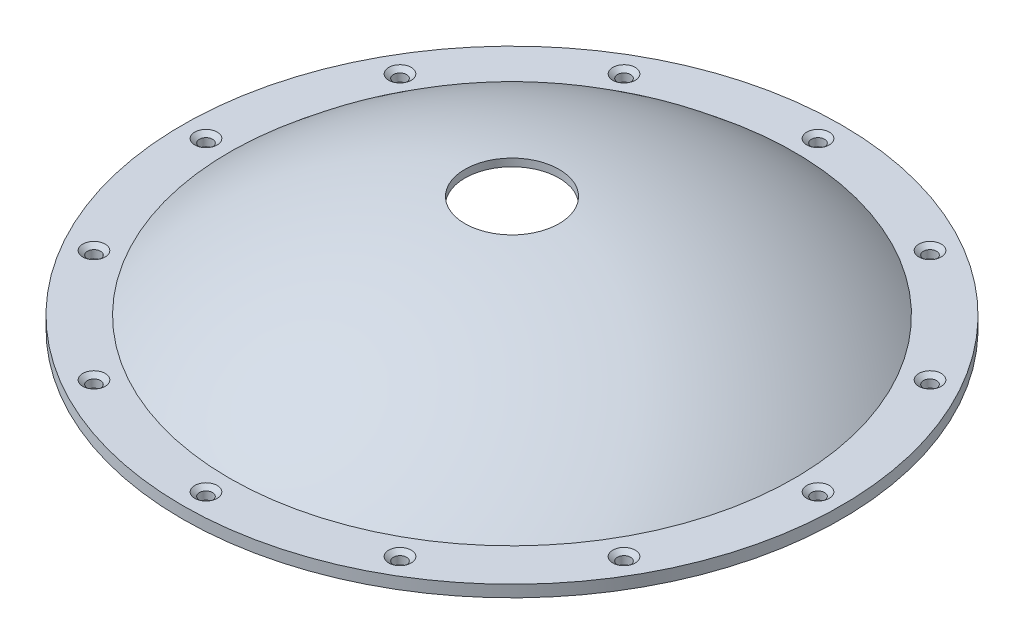
ISO-10303-21;
HEADER;
FILE_DESCRIPTION(('STEP AP214'),'2;1');
FILE_NAME('part.step','',(''),(''),'','','');
FILE_SCHEMA(('AUTOMOTIVE_DESIGN { 1 0 10303 214 1 1 1 1 }'));
ENDSEC;
DATA;
#1=APPLICATION_CONTEXT('core data for automotive mechanical design processes');
#2=APPLICATION_PROTOCOL_DEFINITION('international standard','automotive_design',2000,#1);
#3=PRODUCT_CONTEXT('',#1,'mechanical');
#4=PRODUCT('Part','Part','',(#3));
#5=PRODUCT_RELATED_PRODUCT_CATEGORY('part','',(#4));
#6=PRODUCT_DEFINITION_FORMATION('','',#4);
#7=PRODUCT_DEFINITION_CONTEXT('part definition',#1,'design');
#8=PRODUCT_DEFINITION('design','',#6,#7);
#9=PRODUCT_DEFINITION_SHAPE('','',#8);
#10=(LENGTH_UNIT() NAMED_UNIT(*) SI_UNIT(.MILLI.,.METRE.));
#11=(NAMED_UNIT(*) PLANE_ANGLE_UNIT() SI_UNIT($,.RADIAN.));
#12=(NAMED_UNIT(*) SI_UNIT($,.STERADIAN.) SOLID_ANGLE_UNIT());
#13=UNCERTAINTY_MEASURE_WITH_UNIT(LENGTH_MEASURE(1.E-05),#10,'distance_accuracy_value','');
#14=(GEOMETRIC_REPRESENTATION_CONTEXT(3) GLOBAL_UNCERTAINTY_ASSIGNED_CONTEXT((#13)) GLOBAL_UNIT_ASSIGNED_CONTEXT((#10,
#11,#12)) REPRESENTATION_CONTEXT('',''));
#15=CARTESIAN_POINT('',(0.,0.,0.));
#16=DIRECTION('',(0.,0.,1.));
#17=DIRECTION('',(1.,0.,0.));
#18=AXIS2_PLACEMENT_3D('',#15,#16,#17);
#19=CARTESIAN_POINT('',(-44.45,0.,0.));
#20=DIRECTION('',(0.,-1.,0.));
#21=DIRECTION('',(0.,0.,-1.));
#22=AXIS2_PLACEMENT_3D('',#19,#20,#21);
#23=PLANE('',#22);
#24=CARTESIAN_POINT('',(0.,0.,0.));
#25=DIRECTION('',(0.,1.,0.));
#26=DIRECTION('',(0.,0.,1.));
#27=AXIS2_PLACEMENT_3D('',#24,#25,#26);
#28=CIRCLE('',#27,44.45);
#29=CARTESIAN_POINT('',(0.,0.,44.45));
#30=VERTEX_POINT('',#29);
#31=EDGE_CURVE('E57',#30,#30,#28,.T.);
#32=ORIENTED_EDGE('',*,*,#31,.F.);
#33=EDGE_LOOP('',(#32));
#34=FACE_BOUND('',#33,.T.);
#35=CARTESIAN_POINT('',(0.,0.,0.));
#36=DIRECTION('',(0.,1.,0.));
#37=DIRECTION('',(0.,0.,1.));
#38=AXIS2_PLACEMENT_3D('',#35,#36,#37);
#39=CIRCLE('',#38,38.1);
#40=CARTESIAN_POINT('',(0.,0.,38.1));
#41=VERTEX_POINT('',#40);
#42=EDGE_CURVE('E54',#41,#41,#39,.T.);
#43=ORIENTED_EDGE('',*,*,#42,.T.);
#44=EDGE_LOOP('',(#43));
#45=FACE_BOUND('',#44,.T.);
#46=CARTESIAN_POINT('',(-41.275,0.,0.));
#47=DIRECTION('',(0.,1.,0.));
#48=DIRECTION('',(0.,0.,1.));
#49=AXIS2_PLACEMENT_3D('',#46,#47,#48);
#50=CIRCLE('',#49,0.889000000000001);
#51=CARTESIAN_POINT('',(-41.275,0.,0.889000000000006));
#52=VERTEX_POINT('',#51);
#53=EDGE_CURVE('E60',#52,#52,#50,.T.);
#54=ORIENTED_EDGE('',*,*,#53,.T.);
#55=EDGE_LOOP('',(#54));
#56=FACE_BOUND('',#55,.T.);
#57=CARTESIAN_POINT('',(-35.7451985412027,0.,-20.6375));
#58=DIRECTION('',(0.,1.,0.));
#59=DIRECTION('',(0.,0.,1.));
#60=AXIS2_PLACEMENT_3D('',#57,#58,#59);
#61=CIRCLE('',#60,0.889000000000001);
#62=CARTESIAN_POINT('',(-35.7451985412027,0.,-19.7485));
#63=VERTEX_POINT('',#62);
#64=EDGE_CURVE('E69',#63,#63,#61,.T.);
#65=ORIENTED_EDGE('',*,*,#64,.T.);
#66=EDGE_LOOP('',(#65));
#67=FACE_BOUND('',#66,.T.);
#68=CARTESIAN_POINT('',(-20.6374999999999,0.,-35.7451985412027));
#69=DIRECTION('',(0.,1.,0.));
#70=DIRECTION('',(0.,0.,1.));
#71=AXIS2_PLACEMENT_3D('',#68,#69,#70);
#72=CIRCLE('',#71,0.889000000000001);
#73=CARTESIAN_POINT('',(-20.6374999999999,0.,-34.8561985412027));
#74=VERTEX_POINT('',#73);
#75=EDGE_CURVE('E78',#74,#74,#72,.T.);
#76=ORIENTED_EDGE('',*,*,#75,.T.);
#77=EDGE_LOOP('',(#76));
#78=FACE_BOUND('',#77,.T.);
#79=CARTESIAN_POINT('',(1.11561489392428E-13,0.,-41.275));
#80=DIRECTION('',(0.,1.,0.));
#81=DIRECTION('',(0.,0.,1.));
#82=AXIS2_PLACEMENT_3D('',#79,#80,#81);
#83=CIRCLE('',#82,0.888999999999999);
#84=CARTESIAN_POINT('',(1.11561489392428E-13,0.,-40.386));
#85=VERTEX_POINT('',#84);
#86=EDGE_CURVE('E87',#85,#85,#83,.T.);
#87=ORIENTED_EDGE('',*,*,#86,.T.);
#88=EDGE_LOOP('',(#87));
#89=FACE_BOUND('',#88,.T.);
#90=CARTESIAN_POINT('',(20.6375000000001,0.,-35.7451985412026));
#91=DIRECTION('',(0.,1.,0.));
#92=DIRECTION('',(0.,0.,1.));
#93=AXIS2_PLACEMENT_3D('',#90,#91,#92);
#94=CIRCLE('',#93,0.889000000000001);
#95=CARTESIAN_POINT('',(20.6375000000001,0.,-34.8561985412026));
#96=VERTEX_POINT('',#95);
#97=EDGE_CURVE('E96',#96,#96,#94,.T.);
#98=ORIENTED_EDGE('',*,*,#97,.T.);
#99=EDGE_LOOP('',(#98));
#100=FACE_BOUND('',#99,.T.);
#101=CARTESIAN_POINT('',(35.7451985412028,0.,-20.6374999999998));
#102=DIRECTION('',(0.,1.,0.));
#103=DIRECTION('',(0.,0.,1.));
#104=AXIS2_PLACEMENT_3D('',#101,#102,#103);
#105=CIRCLE('',#104,0.889000000000001);
#106=CARTESIAN_POINT('',(35.7451985412028,0.,-19.7484999999998));
#107=VERTEX_POINT('',#106);
#108=EDGE_CURVE('E105',#107,#107,#105,.T.);
#109=ORIENTED_EDGE('',*,*,#108,.T.);
#110=EDGE_LOOP('',(#109));
#111=FACE_BOUND('',#110,.T.);
#112=CARTESIAN_POINT('',(41.275,0.,2.28177708448336E-13));
#113=DIRECTION('',(0.,1.,0.));
#114=DIRECTION('',(0.,0.,1.));
#115=AXIS2_PLACEMENT_3D('',#112,#113,#114);
#116=CIRCLE('',#115,0.889000000000001);
#117=CARTESIAN_POINT('',(41.275,0.,0.889000000000229));
#118=VERTEX_POINT('',#117);
#119=EDGE_CURVE('E114',#118,#118,#116,.T.);
#120=ORIENTED_EDGE('',*,*,#119,.T.);
#121=EDGE_LOOP('',(#120));
#122=FACE_BOUND('',#121,.T.);
#123=CARTESIAN_POINT('',(35.7451985412026,0.,20.6375000000002));
#124=DIRECTION('',(0.,1.,0.));
#125=DIRECTION('',(0.,0.,1.));
#126=AXIS2_PLACEMENT_3D('',#123,#124,#125);
#127=CIRCLE('',#126,0.889000000000001);
#128=CARTESIAN_POINT('',(35.7451985412026,0.,21.5265000000002));
#129=VERTEX_POINT('',#128);
#130=EDGE_CURVE('E123',#129,#129,#127,.T.);
#131=ORIENTED_EDGE('',*,*,#130,.T.);
#132=EDGE_LOOP('',(#131));
#133=FACE_BOUND('',#132,.T.);
#134=CARTESIAN_POINT('',(20.6374999999997,0.,35.7451985412029));
#135=DIRECTION('',(0.,1.,0.));
#136=DIRECTION('',(0.,0.,1.));
#137=AXIS2_PLACEMENT_3D('',#134,#135,#136);
#138=CIRCLE('',#137,0.889000000000001);
#139=CARTESIAN_POINT('',(20.6374999999997,0.,36.6341985412029));
#140=VERTEX_POINT('',#139);
#141=EDGE_CURVE('E132',#140,#140,#138,.T.);
#142=ORIENTED_EDGE('',*,*,#141,.T.);
#143=EDGE_LOOP('',(#142));
#144=FACE_BOUND('',#143,.T.);
#145=CARTESIAN_POINT('',(-3.53958818572525E-13,0.,41.275));
#146=DIRECTION('',(0.,1.,0.));
#147=DIRECTION('',(0.,0.,1.));
#148=AXIS2_PLACEMENT_3D('',#145,#146,#147);
#149=CIRCLE('',#148,0.888999999999999);
#150=CARTESIAN_POINT('',(-3.53958818572525E-13,0.,42.164));
#151=VERTEX_POINT('',#150);
#152=EDGE_CURVE('E141',#151,#151,#149,.T.);
#153=ORIENTED_EDGE('',*,*,#152,.T.);
#154=EDGE_LOOP('',(#153));
#155=FACE_BOUND('',#154,.T.);
#156=CARTESIAN_POINT('',(-20.6375000000004,0.,35.7451985412025));
#157=DIRECTION('',(0.,1.,0.));
#158=DIRECTION('',(0.,0.,1.));
#159=AXIS2_PLACEMENT_3D('',#156,#157,#158);
#160=CIRCLE('',#159,0.889000000000001);
#161=CARTESIAN_POINT('',(-20.6375000000004,0.,36.6341985412025));
#162=VERTEX_POINT('',#161);
#163=EDGE_CURVE('E150',#162,#162,#160,.T.);
#164=ORIENTED_EDGE('',*,*,#163,.T.);
#165=EDGE_LOOP('',(#164));
#166=FACE_BOUND('',#165,.T.);
#167=CARTESIAN_POINT('',(-35.7451985412029,0.,20.6374999999996));
#168=DIRECTION('',(0.,1.,0.));
#169=DIRECTION('',(0.,0.,1.));
#170=AXIS2_PLACEMENT_3D('',#167,#168,#169);
#171=CIRCLE('',#170,0.889000000000001);
#172=CARTESIAN_POINT('',(-35.7451985412029,0.,21.5264999999996));
#173=VERTEX_POINT('',#172);
#174=EDGE_CURVE('E159',#173,#173,#171,.T.);
#175=ORIENTED_EDGE('',*,*,#174,.T.);
#176=EDGE_LOOP('',(#175));
#177=FACE_BOUND('',#176,.T.);
#178=ADVANCED_FACE('F31',(#34,#45,#56,#67,#78,#89,#100,#111,#122,#133,#144,#155,#166,#177),#23,.T.);
#179=CARTESIAN_POINT('',(0.,55.,0.));
#180=DIRECTION('',(0.,1.,0.));
#181=DIRECTION('',(0.,0.,1.));
#182=AXIS2_PLACEMENT_3D('',#179,#180,#181);
#183=CYLINDRICAL_SURFACE('',#182,44.45);
#184=ORIENTED_EDGE('',*,*,#31,.T.);
#185=EDGE_LOOP('',(#184));
#186=FACE_BOUND('',#185,.T.);
#187=CARTESIAN_POINT('',(0.,1.5875,0.));
#188=DIRECTION('',(0.,1.,0.));
#189=DIRECTION('',(0.,0.,1.));
#190=AXIS2_PLACEMENT_3D('',#187,#188,#189);
#191=CIRCLE('',#190,44.45);
#192=CARTESIAN_POINT('',(0.,1.5875,44.45));
#193=VERTEX_POINT('',#192);
#194=EDGE_CURVE('E10',#193,#193,#191,.T.);
#195=ORIENTED_EDGE('',*,*,#194,.F.);
#196=EDGE_LOOP('',(#195));
#197=FACE_BOUND('',#196,.T.);
#198=ADVANCED_FACE('F33',(#186,#197),#183,.T.);
#199=CARTESIAN_POINT('',(-44.45,1.5875,0.));
#200=DIRECTION('',(0.,1.,0.));
#201=DIRECTION('',(0.,0.,1.));
#202=AXIS2_PLACEMENT_3D('',#199,#200,#201);
#203=PLANE('',#202);
#204=CARTESIAN_POINT('',(-35.7451985412029,1.5875,20.6374999999996));
#205=DIRECTION('',(0.,1.,0.));
#206=DIRECTION('',(0.,0.,1.));
#207=AXIS2_PLACEMENT_3D('',#204,#205,#206);
#208=CIRCLE('',#207,1.5113);
#209=CARTESIAN_POINT('',(-35.7451985412029,1.5875,22.1487999999996));
#210=VERTEX_POINT('',#209);
#211=EDGE_CURVE('E165',#210,#210,#208,.T.);
#212=ORIENTED_EDGE('',*,*,#211,.F.);
#213=EDGE_LOOP('',(#212));
#214=FACE_BOUND('',#213,.T.);
#215=CARTESIAN_POINT('',(-20.6375000000004,1.5875,35.7451985412025));
#216=DIRECTION('',(0.,1.,0.));
#217=DIRECTION('',(0.,0.,1.));
#218=AXIS2_PLACEMENT_3D('',#215,#216,#217);
#219=CIRCLE('',#218,1.5113);
#220=CARTESIAN_POINT('',(-20.6375000000004,1.5875,37.2564985412025));
#221=VERTEX_POINT('',#220);
#222=EDGE_CURVE('E156',#221,#221,#219,.T.);
#223=ORIENTED_EDGE('',*,*,#222,.F.);
#224=EDGE_LOOP('',(#223));
#225=FACE_BOUND('',#224,.T.);
#226=CARTESIAN_POINT('',(-3.53958818572525E-13,1.5875,41.275));
#227=DIRECTION('',(0.,1.,0.));
#228=DIRECTION('',(0.,0.,1.));
#229=AXIS2_PLACEMENT_3D('',#226,#227,#228);
#230=CIRCLE('',#229,1.5113);
#231=CARTESIAN_POINT('',(-3.53958818572525E-13,1.5875,42.7863));
#232=VERTEX_POINT('',#231);
#233=EDGE_CURVE('E147',#232,#232,#230,.T.);
#234=ORIENTED_EDGE('',*,*,#233,.F.);
#235=EDGE_LOOP('',(#234));
#236=FACE_BOUND('',#235,.T.);
#237=CARTESIAN_POINT('',(20.6374999999997,1.5875,35.7451985412029));
#238=DIRECTION('',(0.,1.,0.));
#239=DIRECTION('',(0.,0.,1.));
#240=AXIS2_PLACEMENT_3D('',#237,#238,#239);
#241=CIRCLE('',#240,1.5113);
#242=CARTESIAN_POINT('',(20.6374999999997,1.5875,37.2564985412029));
#243=VERTEX_POINT('',#242);
#244=EDGE_CURVE('E138',#243,#243,#241,.T.);
#245=ORIENTED_EDGE('',*,*,#244,.F.);
#246=EDGE_LOOP('',(#245));
#247=FACE_BOUND('',#246,.T.);
#248=CARTESIAN_POINT('',(35.7451985412026,1.5875,20.6375000000002));
#249=DIRECTION('',(0.,1.,0.));
#250=DIRECTION('',(0.,0.,1.));
#251=AXIS2_PLACEMENT_3D('',#248,#249,#250);
#252=CIRCLE('',#251,1.5113);
#253=CARTESIAN_POINT('',(35.7451985412026,1.5875,22.1488000000002));
#254=VERTEX_POINT('',#253);
#255=EDGE_CURVE('E129',#254,#254,#252,.T.);
#256=ORIENTED_EDGE('',*,*,#255,.F.);
#257=EDGE_LOOP('',(#256));
#258=FACE_BOUND('',#257,.T.);
#259=CARTESIAN_POINT('',(41.275,1.5875,2.28177708448336E-13));
#260=DIRECTION('',(0.,1.,0.));
#261=DIRECTION('',(0.,0.,1.));
#262=AXIS2_PLACEMENT_3D('',#259,#260,#261);
#263=CIRCLE('',#262,1.5113);
#264=CARTESIAN_POINT('',(41.275,1.5875,1.51130000000023));
#265=VERTEX_POINT('',#264);
#266=EDGE_CURVE('E120',#265,#265,#263,.T.);
#267=ORIENTED_EDGE('',*,*,#266,.F.);
#268=EDGE_LOOP('',(#267));
#269=FACE_BOUND('',#268,.T.);
#270=CARTESIAN_POINT('',(35.7451985412028,1.5875,-20.6374999999998));
#271=DIRECTION('',(0.,1.,0.));
#272=DIRECTION('',(0.,0.,1.));
#273=AXIS2_PLACEMENT_3D('',#270,#271,#272);
#274=CIRCLE('',#273,1.5113);
#275=CARTESIAN_POINT('',(35.7451985412028,1.5875,-19.1261999999998));
#276=VERTEX_POINT('',#275);
#277=EDGE_CURVE('E111',#276,#276,#274,.T.);
#278=ORIENTED_EDGE('',*,*,#277,.F.);
#279=EDGE_LOOP('',(#278));
#280=FACE_BOUND('',#279,.T.);
#281=CARTESIAN_POINT('',(20.6375000000001,1.5875,-35.7451985412026));
#282=DIRECTION('',(0.,1.,0.));
#283=DIRECTION('',(0.,0.,1.));
#284=AXIS2_PLACEMENT_3D('',#281,#282,#283);
#285=CIRCLE('',#284,1.5113);
#286=CARTESIAN_POINT('',(20.6375000000001,1.5875,-34.2338985412026));
#287=VERTEX_POINT('',#286);
#288=EDGE_CURVE('E102',#287,#287,#285,.T.);
#289=ORIENTED_EDGE('',*,*,#288,.F.);
#290=EDGE_LOOP('',(#289));
#291=FACE_BOUND('',#290,.T.);
#292=CARTESIAN_POINT('',(1.11561489392428E-13,1.5875,-41.275));
#293=DIRECTION('',(0.,1.,0.));
#294=DIRECTION('',(0.,0.,1.));
#295=AXIS2_PLACEMENT_3D('',#292,#293,#294);
#296=CIRCLE('',#295,1.5113);
#297=CARTESIAN_POINT('',(1.11561489392428E-13,1.5875,-39.7637));
#298=VERTEX_POINT('',#297);
#299=EDGE_CURVE('E93',#298,#298,#296,.T.);
#300=ORIENTED_EDGE('',*,*,#299,.F.);
#301=EDGE_LOOP('',(#300));
#302=FACE_BOUND('',#301,.T.);
#303=CARTESIAN_POINT('',(-20.6374999999999,1.5875,-35.7451985412027));
#304=DIRECTION('',(0.,1.,0.));
#305=DIRECTION('',(0.,0.,1.));
#306=AXIS2_PLACEMENT_3D('',#303,#304,#305);
#307=CIRCLE('',#306,1.5113);
#308=CARTESIAN_POINT('',(-20.6374999999999,1.5875,-34.2338985412027));
#309=VERTEX_POINT('',#308);
#310=EDGE_CURVE('E84',#309,#309,#307,.T.);
#311=ORIENTED_EDGE('',*,*,#310,.F.);
#312=EDGE_LOOP('',(#311));
#313=FACE_BOUND('',#312,.T.);
#314=CARTESIAN_POINT('',(-35.7451985412027,1.5875,-20.6375));
#315=DIRECTION('',(0.,1.,0.));
#316=DIRECTION('',(0.,0.,1.));
#317=AXIS2_PLACEMENT_3D('',#314,#315,#316);
#318=CIRCLE('',#317,1.5113);
#319=CARTESIAN_POINT('',(-35.7451985412027,1.5875,-19.1262));
#320=VERTEX_POINT('',#319);
#321=EDGE_CURVE('E75',#320,#320,#318,.T.);
#322=ORIENTED_EDGE('',*,*,#321,.F.);
#323=EDGE_LOOP('',(#322));
#324=FACE_BOUND('',#323,.T.);
#325=CARTESIAN_POINT('',(-41.275,1.5875,0.));
#326=DIRECTION('',(0.,1.,0.));
#327=DIRECTION('',(0.,0.,1.));
#328=AXIS2_PLACEMENT_3D('',#325,#326,#327);
#329=CIRCLE('',#328,1.5113);
#330=CARTESIAN_POINT('',(-41.275,1.5875,1.51130000000001));
#331=VERTEX_POINT('',#330);
#332=EDGE_CURVE('E66',#331,#331,#329,.T.);
#333=ORIENTED_EDGE('',*,*,#332,.F.);
#334=EDGE_LOOP('',(#333));
#335=FACE_BOUND('',#334,.T.);
#336=ORIENTED_EDGE('',*,*,#194,.T.);
#337=EDGE_LOOP('',(#336));
#338=FACE_BOUND('',#337,.T.);
#339=CARTESIAN_POINT('',(0.,1.5875,0.));
#340=DIRECTION('',(0.,1.,0.));
#341=DIRECTION('',(0.,0.,1.));
#342=AXIS2_PLACEMENT_3D('',#339,#340,#341);
#343=CIRCLE('',#342,38.1);
#344=CARTESIAN_POINT('',(0.,1.5875,38.1));
#345=VERTEX_POINT('',#344);
#346=EDGE_CURVE('E38',#345,#345,#343,.T.);
#347=ORIENTED_EDGE('',*,*,#346,.F.);
#348=EDGE_LOOP('',(#347));
#349=FACE_BOUND('',#348,.T.);
#350=ADVANCED_FACE('F171',(#214,#225,#236,#247,#258,#269,#280,#291,#302,#313,#324,#335,#338,
#349),#203,.T.);
#351=CARTESIAN_POINT('',(0.,-42.3633083657172,0.));
#352=DIRECTION('',(0.,1.,0.));
#353=DIRECTION('',(-1.,0.,0.));
#354=AXIS2_PLACEMENT_3D('',#351,#352,#353);
#355=SPHERICAL_SURFACE('',#354,58.166);
#356=ORIENTED_EDGE('',*,*,#346,.T.);
#357=EDGE_LOOP('',(#356));
#358=FACE_BOUND('',#357,.T.);
#359=CARTESIAN_POINT('',(0.,15.4550369582368,0.));
#360=DIRECTION('',(0.,1.,0.));
#361=DIRECTION('',(0.,0.,1.));
#362=AXIS2_PLACEMENT_3D('',#359,#360,#361);
#363=CIRCLE('',#362,6.35000000000001);
#364=CARTESIAN_POINT('',(0.,15.4550369582368,6.35000000000001));
#365=VERTEX_POINT('',#364);
#366=EDGE_CURVE('E42',#365,#365,#363,.T.);
#367=ORIENTED_EDGE('',*,*,#366,.F.);
#368=EDGE_LOOP('',(#367));
#369=FACE_BOUND('',#368,.T.);
#370=ADVANCED_FACE('F174',(#358,#369),#355,.T.);
#371=CARTESIAN_POINT('',(0.,55.,0.));
#372=DIRECTION('',(0.,1.,0.));
#373=DIRECTION('',(0.,0.,1.));
#374=AXIS2_PLACEMENT_3D('',#371,#372,#373);
#375=CYLINDRICAL_SURFACE('',#374,6.35000000000001);
#376=ORIENTED_EDGE('',*,*,#366,.T.);
#377=EDGE_LOOP('',(#376));
#378=FACE_BOUND('',#377,.T.);
#379=CARTESIAN_POINT('',(0.,14.4328182627774,0.));
#380=DIRECTION('',(0.,1.,0.));
#381=DIRECTION('',(0.,0.,1.));
#382=AXIS2_PLACEMENT_3D('',#379,#380,#381);
#383=CIRCLE('',#382,6.35000000000001);
#384=CARTESIAN_POINT('',(0.,14.4328182627774,6.35000000000001));
#385=VERTEX_POINT('',#384);
#386=EDGE_CURVE('E46',#385,#385,#383,.T.);
#387=ORIENTED_EDGE('',*,*,#386,.F.);
#388=EDGE_LOOP('',(#387));
#389=FACE_BOUND('',#388,.T.);
#390=ADVANCED_FACE('F231',(#378,#389),#375,.F.);
#391=CARTESIAN_POINT('',(0.,-42.3633083657172,0.));
#392=DIRECTION('',(0.,1.,0.));
#393=DIRECTION('',(-1.,0.,0.));
#394=AXIS2_PLACEMENT_3D('',#391,#392,#393);
#395=SPHERICAL_SURFACE('',#394,57.15);
#396=ORIENTED_EDGE('',*,*,#386,.T.);
#397=EDGE_LOOP('',(#396));
#398=FACE_BOUND('',#397,.T.);
#399=CARTESIAN_POINT('',(0.,0.390000091335399,0.));
#400=DIRECTION('',(0.,1.,0.));
#401=DIRECTION('',(0.,0.,1.));
#402=AXIS2_PLACEMENT_3D('',#399,#400,#401);
#403=CIRCLE('',#402,37.924624137572);
#404=CARTESIAN_POINT('',(0.,0.390000091335399,37.924624137572));
#405=VERTEX_POINT('',#404);
#406=EDGE_CURVE('E51',#405,#405,#403,.T.);
#407=ORIENTED_EDGE('',*,*,#406,.F.);
#408=EDGE_LOOP('',(#407));
#409=FACE_BOUND('',#408,.T.);
#410=ADVANCED_FACE('F227',(#398,#409),#395,.F.);
#411=CARTESIAN_POINT('',(0.,0.,0.));
#412=DIRECTION('',(0.,1.,0.));
#413=DIRECTION('',(0.,0.,1.));
#414=AXIS2_PLACEMENT_3D('',#411,#412,#413);
#415=TOROIDAL_SURFACE('',#414,37.5786718028569,0.521328197143094);
#416=ORIENTED_EDGE('',*,*,#406,.T.);
#417=EDGE_LOOP('',(#416));
#418=FACE_BOUND('',#417,.T.);
#419=ORIENTED_EDGE('',*,*,#42,.F.);
#420=EDGE_LOOP('',(#419));
#421=FACE_BOUND('',#420,.T.);
#422=ADVANCED_FACE('F211',(#418,#421),#415,.F.);
#423=CARTESIAN_POINT('',(-41.275,1.5875,0.));
#424=DIRECTION('',(0.,1.,0.));
#425=DIRECTION('',(0.,0.,1.));
#426=AXIS2_PLACEMENT_3D('',#423,#424,#425);
#427=CYLINDRICAL_SURFACE('',#426,0.889000000000001);
#428=ORIENTED_EDGE('',*,*,#53,.F.);
#429=EDGE_LOOP('',(#428));
#430=FACE_BOUND('',#429,.T.);
#431=CARTESIAN_POINT('',(-41.275,1.06532829951838,0.));
#432=DIRECTION('',(0.,1.,0.));
#433=DIRECTION('',(0.,0.,1.));
#434=AXIS2_PLACEMENT_3D('',#431,#432,#433);
#435=CIRCLE('',#434,0.889000000000001);
#436=CARTESIAN_POINT('',(-41.275,1.06532829951838,0.889000000000006));
#437=VERTEX_POINT('',#436);
#438=EDGE_CURVE('E63',#437,#437,#435,.T.);
#439=ORIENTED_EDGE('',*,*,#438,.T.);
#440=EDGE_LOOP('',(#439));
#441=FACE_BOUND('',#440,.T.);
#442=ADVANCED_FACE('F201',(#430,#441),#427,.F.);
#443=CARTESIAN_POINT('',(-41.275,1.5875,0.));
#444=DIRECTION('',(0.,1.,0.));
#445=DIRECTION('',(0.,0.,1.));
#446=AXIS2_PLACEMENT_3D('',#443,#444,#445);
#447=CONICAL_SURFACE('',#446,1.5113,0.872664625997162);
#448=ORIENTED_EDGE('',*,*,#438,.F.);
#449=EDGE_LOOP('',(#448));
#450=FACE_BOUND('',#449,.T.);
#451=ORIENTED_EDGE('',*,*,#332,.T.);
#452=EDGE_LOOP('',(#451));
#453=FACE_BOUND('',#452,.T.);
#454=ADVANCED_FACE('F198',(#450,#453),#447,.F.);
#455=CARTESIAN_POINT('',(-35.7451985412027,1.5875,-20.6375));
#456=DIRECTION('',(0.,1.,0.));
#457=DIRECTION('',(0.,0.,1.));
#458=AXIS2_PLACEMENT_3D('',#455,#456,#457);
#459=CYLINDRICAL_SURFACE('',#458,0.889000000000001);
#460=ORIENTED_EDGE('',*,*,#64,.F.);
#461=EDGE_LOOP('',(#460));
#462=FACE_BOUND('',#461,.T.);
#463=CARTESIAN_POINT('',(-35.7451985412027,1.06532829951838,-20.6375));
#464=DIRECTION('',(0.,1.,0.));
#465=DIRECTION('',(0.,0.,1.));
#466=AXIS2_PLACEMENT_3D('',#463,#464,#465);
#467=CIRCLE('',#466,0.889000000000001);
#468=CARTESIAN_POINT('',(-35.7451985412027,1.06532829951838,-19.7485));
#469=VERTEX_POINT('',#468);
#470=EDGE_CURVE('E72',#469,#469,#467,.T.);
#471=ORIENTED_EDGE('',*,*,#470,.T.);
#472=EDGE_LOOP('',(#471));
#473=FACE_BOUND('',#472,.T.);
#474=ADVANCED_FACE('F200',(#462,#473),#459,.F.);
#475=CARTESIAN_POINT('',(-35.7451985412027,1.5875,-20.6375));
#476=DIRECTION('',(0.,1.,0.));
#477=DIRECTION('',(0.,0.,1.));
#478=AXIS2_PLACEMENT_3D('',#475,#476,#477);
#479=CONICAL_SURFACE('',#478,1.5113,0.872664625997162);
#480=ORIENTED_EDGE('',*,*,#470,.F.);
#481=EDGE_LOOP('',(#480));
#482=FACE_BOUND('',#481,.T.);
#483=ORIENTED_EDGE('',*,*,#321,.T.);
#484=EDGE_LOOP('',(#483));
#485=FACE_BOUND('',#484,.T.);
#486=ADVANCED_FACE('F208',(#482,#485),#479,.F.);
#487=CARTESIAN_POINT('',(-20.6374999999999,1.5875,-35.7451985412027));
#488=DIRECTION('',(0.,1.,0.));
#489=DIRECTION('',(0.,0.,1.));
#490=AXIS2_PLACEMENT_3D('',#487,#488,#489);
#491=CYLINDRICAL_SURFACE('',#490,0.889000000000001);
#492=ORIENTED_EDGE('',*,*,#75,.F.);
#493=EDGE_LOOP('',(#492));
#494=FACE_BOUND('',#493,.T.);
#495=CARTESIAN_POINT('',(-20.6374999999999,1.06532829951838,-35.7451985412027));
#496=DIRECTION('',(0.,1.,0.));
#497=DIRECTION('',(0.,0.,1.));
#498=AXIS2_PLACEMENT_3D('',#495,#496,#497);
#499=CIRCLE('',#498,0.889000000000001);
#500=CARTESIAN_POINT('',(-20.6374999999999,1.06532829951838,-34.8561985412027));
#501=VERTEX_POINT('',#500);
#502=EDGE_CURVE('E81',#501,#501,#499,.T.);
#503=ORIENTED_EDGE('',*,*,#502,.T.);
#504=EDGE_LOOP('',(#503));
#505=FACE_BOUND('',#504,.T.);
#506=ADVANCED_FACE('F350',(#494,#505),#491,.F.);
#507=CARTESIAN_POINT('',(-20.6374999999999,1.5875,-35.7451985412027));
#508=DIRECTION('',(0.,1.,0.));
#509=DIRECTION('',(0.,0.,1.));
#510=AXIS2_PLACEMENT_3D('',#507,#508,#509);
#511=CONICAL_SURFACE('',#510,1.5113,0.872664625997162);
#512=ORIENTED_EDGE('',*,*,#502,.F.);
#513=EDGE_LOOP('',(#512));
#514=FACE_BOUND('',#513,.T.);
#515=ORIENTED_EDGE('',*,*,#310,.T.);
#516=EDGE_LOOP('',(#515));
#517=FACE_BOUND('',#516,.T.);
#518=ADVANCED_FACE('F346',(#514,#517),#511,.F.);
#519=CARTESIAN_POINT('',(1.11561489392428E-13,1.5875,-41.275));
#520=DIRECTION('',(0.,1.,0.));
#521=DIRECTION('',(0.,0.,1.));
#522=AXIS2_PLACEMENT_3D('',#519,#520,#521);
#523=CYLINDRICAL_SURFACE('',#522,0.888999999999999);
#524=ORIENTED_EDGE('',*,*,#86,.F.);
#525=EDGE_LOOP('',(#524));
#526=FACE_BOUND('',#525,.T.);
#527=CARTESIAN_POINT('',(1.11561489392428E-13,1.06532829951838,-41.275));
#528=DIRECTION('',(0.,1.,0.));
#529=DIRECTION('',(0.,0.,1.));
#530=AXIS2_PLACEMENT_3D('',#527,#528,#529);
#531=CIRCLE('',#530,0.888999999999999);
#532=CARTESIAN_POINT('',(1.11561489392428E-13,1.06532829951838,-40.386));
#533=VERTEX_POINT('',#532);
#534=EDGE_CURVE('E90',#533,#533,#531,.T.);
#535=ORIENTED_EDGE('',*,*,#534,.T.);
#536=EDGE_LOOP('',(#535));
#537=FACE_BOUND('',#536,.T.);
#538=ADVANCED_FACE('F342',(#526,#537),#523,.F.);
#539=CARTESIAN_POINT('',(1.11561489392428E-13,1.5875,-41.275));
#540=DIRECTION('',(0.,1.,0.));
#541=DIRECTION('',(0.,0.,1.));
#542=AXIS2_PLACEMENT_3D('',#539,#540,#541);
#543=CONICAL_SURFACE('',#542,1.5113,0.872664625997163);
#544=ORIENTED_EDGE('',*,*,#534,.F.);
#545=EDGE_LOOP('',(#544));
#546=FACE_BOUND('',#545,.T.);
#547=ORIENTED_EDGE('',*,*,#299,.T.);
#548=EDGE_LOOP('',(#547));
#549=FACE_BOUND('',#548,.T.);
#550=ADVANCED_FACE('F338',(#546,#549),#543,.F.);
#551=CARTESIAN_POINT('',(20.6375000000001,1.5875,-35.7451985412026));
#552=DIRECTION('',(0.,1.,0.));
#553=DIRECTION('',(0.,0.,1.));
#554=AXIS2_PLACEMENT_3D('',#551,#552,#553);
#555=CYLINDRICAL_SURFACE('',#554,0.889000000000001);
#556=ORIENTED_EDGE('',*,*,#97,.F.);
#557=EDGE_LOOP('',(#556));
#558=FACE_BOUND('',#557,.T.);
#559=CARTESIAN_POINT('',(20.6375000000001,1.06532829951838,-35.7451985412026));
#560=DIRECTION('',(0.,1.,0.));
#561=DIRECTION('',(0.,0.,1.));
#562=AXIS2_PLACEMENT_3D('',#559,#560,#561);
#563=CIRCLE('',#562,0.889000000000001);
#564=CARTESIAN_POINT('',(20.6375000000001,1.06532829951838,-34.8561985412026));
#565=VERTEX_POINT('',#564);
#566=EDGE_CURVE('E99',#565,#565,#563,.T.);
#567=ORIENTED_EDGE('',*,*,#566,.T.);
#568=EDGE_LOOP('',(#567));
#569=FACE_BOUND('',#568,.T.);
#570=ADVANCED_FACE('F334',(#558,#569),#555,.F.);
#571=CARTESIAN_POINT('',(20.6375000000001,1.5875,-35.7451985412026));
#572=DIRECTION('',(0.,1.,0.));
#573=DIRECTION('',(0.,0.,1.));
#574=AXIS2_PLACEMENT_3D('',#571,#572,#573);
#575=CONICAL_SURFACE('',#574,1.5113,0.872664625997162);
#576=ORIENTED_EDGE('',*,*,#566,.F.);
#577=EDGE_LOOP('',(#576));
#578=FACE_BOUND('',#577,.T.);
#579=ORIENTED_EDGE('',*,*,#288,.T.);
#580=EDGE_LOOP('',(#579));
#581=FACE_BOUND('',#580,.T.);
#582=ADVANCED_FACE('F330',(#578,#581),#575,.F.);
#583=CARTESIAN_POINT('',(35.7451985412028,1.5875,-20.6374999999998));
#584=DIRECTION('',(0.,1.,0.));
#585=DIRECTION('',(0.,0.,1.));
#586=AXIS2_PLACEMENT_3D('',#583,#584,#585);
#587=CYLINDRICAL_SURFACE('',#586,0.889000000000001);
#588=ORIENTED_EDGE('',*,*,#108,.F.);
#589=EDGE_LOOP('',(#588));
#590=FACE_BOUND('',#589,.T.);
#591=CARTESIAN_POINT('',(35.7451985412028,1.06532829951838,-20.6374999999998));
#592=DIRECTION('',(0.,1.,0.));
#593=DIRECTION('',(0.,0.,1.));
#594=AXIS2_PLACEMENT_3D('',#591,#592,#593);
#595=CIRCLE('',#594,0.889000000000001);
#596=CARTESIAN_POINT('',(35.7451985412028,1.06532829951838,-19.7484999999998));
#597=VERTEX_POINT('',#596);
#598=EDGE_CURVE('E108',#597,#597,#595,.T.);
#599=ORIENTED_EDGE('',*,*,#598,.T.);
#600=EDGE_LOOP('',(#599));
#601=FACE_BOUND('',#600,.T.);
#602=ADVANCED_FACE('F326',(#590,#601),#587,.F.);
#603=CARTESIAN_POINT('',(35.7451985412028,1.5875,-20.6374999999998));
#604=DIRECTION('',(0.,1.,0.));
#605=DIRECTION('',(0.,0.,1.));
#606=AXIS2_PLACEMENT_3D('',#603,#604,#605);
#607=CONICAL_SURFACE('',#606,1.5113,0.872664625997162);
#608=ORIENTED_EDGE('',*,*,#598,.F.);
#609=EDGE_LOOP('',(#608));
#610=FACE_BOUND('',#609,.T.);
#611=ORIENTED_EDGE('',*,*,#277,.T.);
#612=EDGE_LOOP('',(#611));
#613=FACE_BOUND('',#612,.T.);
#614=ADVANCED_FACE('F322',(#610,#613),#607,.F.);
#615=CARTESIAN_POINT('',(41.275,1.5875,2.28177708448336E-13));
#616=DIRECTION('',(0.,1.,0.));
#617=DIRECTION('',(0.,0.,1.));
#618=AXIS2_PLACEMENT_3D('',#615,#616,#617);
#619=CYLINDRICAL_SURFACE('',#618,0.889000000000001);
#620=ORIENTED_EDGE('',*,*,#119,.F.);
#621=EDGE_LOOP('',(#620));
#622=FACE_BOUND('',#621,.T.);
#623=CARTESIAN_POINT('',(41.275,1.06532829951838,2.28177708448336E-13));
#624=DIRECTION('',(0.,1.,0.));
#625=DIRECTION('',(0.,0.,1.));
#626=AXIS2_PLACEMENT_3D('',#623,#624,#625);
#627=CIRCLE('',#626,0.889000000000001);
#628=CARTESIAN_POINT('',(41.275,1.06532829951838,0.889000000000229));
#629=VERTEX_POINT('',#628);
#630=EDGE_CURVE('E117',#629,#629,#627,.T.);
#631=ORIENTED_EDGE('',*,*,#630,.T.);
#632=EDGE_LOOP('',(#631));
#633=FACE_BOUND('',#632,.T.);
#634=ADVANCED_FACE('F318',(#622,#633),#619,.F.);
#635=CARTESIAN_POINT('',(41.275,1.5875,2.28177708448336E-13));
#636=DIRECTION('',(0.,1.,0.));
#637=DIRECTION('',(0.,0.,1.));
#638=AXIS2_PLACEMENT_3D('',#635,#636,#637);
#639=CONICAL_SURFACE('',#638,1.5113,0.872664625997162);
#640=ORIENTED_EDGE('',*,*,#630,.F.);
#641=EDGE_LOOP('',(#640));
#642=FACE_BOUND('',#641,.T.);
#643=ORIENTED_EDGE('',*,*,#266,.T.);
#644=EDGE_LOOP('',(#643));
#645=FACE_BOUND('',#644,.T.);
#646=ADVANCED_FACE('F314',(#642,#645),#639,.F.);
#647=CARTESIAN_POINT('',(35.7451985412026,1.5875,20.6375000000002));
#648=DIRECTION('',(0.,1.,0.));
#649=DIRECTION('',(0.,0.,1.));
#650=AXIS2_PLACEMENT_3D('',#647,#648,#649);
#651=CYLINDRICAL_SURFACE('',#650,0.889000000000001);
#652=ORIENTED_EDGE('',*,*,#130,.F.);
#653=EDGE_LOOP('',(#652));
#654=FACE_BOUND('',#653,.T.);
#655=CARTESIAN_POINT('',(35.7451985412026,1.06532829951838,20.6375000000002));
#656=DIRECTION('',(0.,1.,0.));
#657=DIRECTION('',(0.,0.,1.));
#658=AXIS2_PLACEMENT_3D('',#655,#656,#657);
#659=CIRCLE('',#658,0.889000000000001);
#660=CARTESIAN_POINT('',(35.7451985412026,1.06532829951838,21.5265000000002));
#661=VERTEX_POINT('',#660);
#662=EDGE_CURVE('E126',#661,#661,#659,.T.);
#663=ORIENTED_EDGE('',*,*,#662,.T.);
#664=EDGE_LOOP('',(#663));
#665=FACE_BOUND('',#664,.T.);
#666=ADVANCED_FACE('F310',(#654,#665),#651,.F.);
#667=CARTESIAN_POINT('',(35.7451985412026,1.5875,20.6375000000002));
#668=DIRECTION('',(0.,1.,0.));
#669=DIRECTION('',(0.,0.,1.));
#670=AXIS2_PLACEMENT_3D('',#667,#668,#669);
#671=CONICAL_SURFACE('',#670,1.5113,0.872664625997162);
#672=ORIENTED_EDGE('',*,*,#662,.F.);
#673=EDGE_LOOP('',(#672));
#674=FACE_BOUND('',#673,.T.);
#675=ORIENTED_EDGE('',*,*,#255,.T.);
#676=EDGE_LOOP('',(#675));
#677=FACE_BOUND('',#676,.T.);
#678=ADVANCED_FACE('F306',(#674,#677),#671,.F.);
#679=CARTESIAN_POINT('',(20.6374999999997,1.5875,35.7451985412029));
#680=DIRECTION('',(0.,1.,0.));
#681=DIRECTION('',(0.,0.,1.));
#682=AXIS2_PLACEMENT_3D('',#679,#680,#681);
#683=CYLINDRICAL_SURFACE('',#682,0.889000000000001);
#684=ORIENTED_EDGE('',*,*,#141,.F.);
#685=EDGE_LOOP('',(#684));
#686=FACE_BOUND('',#685,.T.);
#687=CARTESIAN_POINT('',(20.6374999999997,1.06532829951838,35.7451985412029));
#688=DIRECTION('',(0.,1.,0.));
#689=DIRECTION('',(0.,0.,1.));
#690=AXIS2_PLACEMENT_3D('',#687,#688,#689);
#691=CIRCLE('',#690,0.889000000000001);
#692=CARTESIAN_POINT('',(20.6374999999997,1.06532829951838,36.6341985412029));
#693=VERTEX_POINT('',#692);
#694=EDGE_CURVE('E135',#693,#693,#691,.T.);
#695=ORIENTED_EDGE('',*,*,#694,.T.);
#696=EDGE_LOOP('',(#695));
#697=FACE_BOUND('',#696,.T.);
#698=ADVANCED_FACE('F302',(#686,#697),#683,.F.);
#699=CARTESIAN_POINT('',(20.6374999999997,1.5875,35.7451985412029));
#700=DIRECTION('',(0.,1.,0.));
#701=DIRECTION('',(0.,0.,1.));
#702=AXIS2_PLACEMENT_3D('',#699,#700,#701);
#703=CONICAL_SURFACE('',#702,1.5113,0.872664625997162);
#704=ORIENTED_EDGE('',*,*,#694,.F.);
#705=EDGE_LOOP('',(#704));
#706=FACE_BOUND('',#705,.T.);
#707=ORIENTED_EDGE('',*,*,#244,.T.);
#708=EDGE_LOOP('',(#707));
#709=FACE_BOUND('',#708,.T.);
#710=ADVANCED_FACE('F298',(#706,#709),#703,.F.);
#711=CARTESIAN_POINT('',(-3.53958818572525E-13,1.5875,41.275));
#712=DIRECTION('',(0.,1.,0.));
#713=DIRECTION('',(0.,0.,1.));
#714=AXIS2_PLACEMENT_3D('',#711,#712,#713);
#715=CYLINDRICAL_SURFACE('',#714,0.888999999999999);
#716=ORIENTED_EDGE('',*,*,#152,.F.);
#717=EDGE_LOOP('',(#716));
#718=FACE_BOUND('',#717,.T.);
#719=CARTESIAN_POINT('',(-3.53958818572525E-13,1.06532829951838,41.275));
#720=DIRECTION('',(0.,1.,0.));
#721=DIRECTION('',(0.,0.,1.));
#722=AXIS2_PLACEMENT_3D('',#719,#720,#721);
#723=CIRCLE('',#722,0.888999999999999);
#724=CARTESIAN_POINT('',(-3.53958818572525E-13,1.06532829951838,42.164));
#725=VERTEX_POINT('',#724);
#726=EDGE_CURVE('E144',#725,#725,#723,.T.);
#727=ORIENTED_EDGE('',*,*,#726,.T.);
#728=EDGE_LOOP('',(#727));
#729=FACE_BOUND('',#728,.T.);
#730=ADVANCED_FACE('F294',(#718,#729),#715,.F.);
#731=CARTESIAN_POINT('',(-3.53958818572525E-13,1.5875,41.275));
#732=DIRECTION('',(0.,1.,0.));
#733=DIRECTION('',(0.,0.,1.));
#734=AXIS2_PLACEMENT_3D('',#731,#732,#733);
#735=CONICAL_SURFACE('',#734,1.5113,0.872664625997163);
#736=ORIENTED_EDGE('',*,*,#726,.F.);
#737=EDGE_LOOP('',(#736));
#738=FACE_BOUND('',#737,.T.);
#739=ORIENTED_EDGE('',*,*,#233,.T.);
#740=EDGE_LOOP('',(#739));
#741=FACE_BOUND('',#740,.T.);
#742=ADVANCED_FACE('F290',(#738,#741),#735,.F.);
#743=CARTESIAN_POINT('',(-20.6375000000004,1.5875,35.7451985412025));
#744=DIRECTION('',(0.,1.,0.));
#745=DIRECTION('',(0.,0.,1.));
#746=AXIS2_PLACEMENT_3D('',#743,#744,#745);
#747=CYLINDRICAL_SURFACE('',#746,0.889000000000001);
#748=ORIENTED_EDGE('',*,*,#163,.F.);
#749=EDGE_LOOP('',(#748));
#750=FACE_BOUND('',#749,.T.);
#751=CARTESIAN_POINT('',(-20.6375000000004,1.06532829951838,35.7451985412025));
#752=DIRECTION('',(0.,1.,0.));
#753=DIRECTION('',(0.,0.,1.));
#754=AXIS2_PLACEMENT_3D('',#751,#752,#753);
#755=CIRCLE('',#754,0.889000000000001);
#756=CARTESIAN_POINT('',(-20.6375000000004,1.06532829951838,36.6341985412025));
#757=VERTEX_POINT('',#756);
#758=EDGE_CURVE('E153',#757,#757,#755,.T.);
#759=ORIENTED_EDGE('',*,*,#758,.T.);
#760=EDGE_LOOP('',(#759));
#761=FACE_BOUND('',#760,.T.);
#762=ADVANCED_FACE('F286',(#750,#761),#747,.F.);
#763=CARTESIAN_POINT('',(-20.6375000000004,1.5875,35.7451985412025));
#764=DIRECTION('',(0.,1.,0.));
#765=DIRECTION('',(0.,0.,1.));
#766=AXIS2_PLACEMENT_3D('',#763,#764,#765);
#767=CONICAL_SURFACE('',#766,1.5113,0.872664625997162);
#768=ORIENTED_EDGE('',*,*,#758,.F.);
#769=EDGE_LOOP('',(#768));
#770=FACE_BOUND('',#769,.T.);
#771=ORIENTED_EDGE('',*,*,#222,.T.);
#772=EDGE_LOOP('',(#771));
#773=FACE_BOUND('',#772,.T.);
#774=ADVANCED_FACE('F275',(#770,#773),#767,.F.);
#775=CARTESIAN_POINT('',(-35.7451985412029,1.5875,20.6374999999996));
#776=DIRECTION('',(0.,1.,0.));
#777=DIRECTION('',(0.,0.,1.));
#778=AXIS2_PLACEMENT_3D('',#775,#776,#777);
#779=CYLINDRICAL_SURFACE('',#778,0.889000000000001);
#780=ORIENTED_EDGE('',*,*,#174,.F.);
#781=EDGE_LOOP('',(#780));
#782=FACE_BOUND('',#781,.T.);
#783=CARTESIAN_POINT('',(-35.7451985412029,1.06532829951838,20.6374999999996));
#784=DIRECTION('',(0.,1.,0.));
#785=DIRECTION('',(0.,0.,1.));
#786=AXIS2_PLACEMENT_3D('',#783,#784,#785);
#787=CIRCLE('',#786,0.889000000000001);
#788=CARTESIAN_POINT('',(-35.7451985412029,1.06532829951838,21.5264999999996));
#789=VERTEX_POINT('',#788);
#790=EDGE_CURVE('E162',#789,#789,#787,.T.);
#791=ORIENTED_EDGE('',*,*,#790,.T.);
#792=EDGE_LOOP('',(#791));
#793=FACE_BOUND('',#792,.T.);
#794=ADVANCED_FACE('F272',(#782,#793),#779,.F.);
#795=CARTESIAN_POINT('',(-35.7451985412029,1.5875,20.6374999999996));
#796=DIRECTION('',(0.,1.,0.));
#797=DIRECTION('',(0.,0.,1.));
#798=AXIS2_PLACEMENT_3D('',#795,#796,#797);
#799=CONICAL_SURFACE('',#798,1.5113,0.872664625997162);
#800=ORIENTED_EDGE('',*,*,#790,.F.);
#801=EDGE_LOOP('',(#800));
#802=FACE_BOUND('',#801,.T.);
#803=ORIENTED_EDGE('',*,*,#211,.T.);
#804=EDGE_LOOP('',(#803));
#805=FACE_BOUND('',#804,.T.);
#806=ADVANCED_FACE('F169',(#802,#805),#799,.F.);
#807=CLOSED_SHELL('',(#178,#198,#350,#370,#390,#410,#422,#442,#454,#474,#486,#506,#518,#538,
#550,#570,#582,#602,#614,#634,#646,#666,#678,#698,#710,#730,#742,#762,#774,#794,#806));
#808=MANIFOLD_SOLID_BREP('B2',#807);
#809=ADVANCED_BREP_SHAPE_REPRESENTATION('',(#18,#808),#14);
#810=SHAPE_DEFINITION_REPRESENTATION(#9,#809);
ENDSEC;
END-ISO-10303-21;
